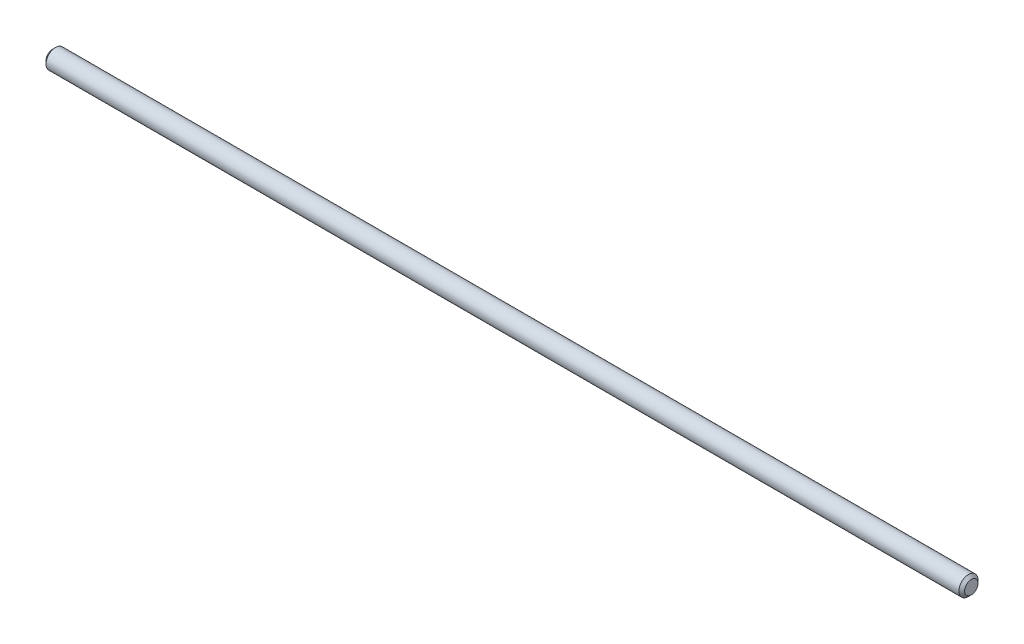
ISO-10303-21;
HEADER;
FILE_DESCRIPTION(('STEP AP214'),'2;1');
FILE_NAME('part.step','',(''),(''),'','','');
FILE_SCHEMA(('AUTOMOTIVE_DESIGN { 1 0 10303 214 1 1 1 1 }'));
ENDSEC;
DATA;
#1=APPLICATION_CONTEXT('core data for automotive mechanical design processes');
#2=APPLICATION_PROTOCOL_DEFINITION('international standard','automotive_design',2000,#1);
#3=PRODUCT_CONTEXT('',#1,'mechanical');
#4=PRODUCT('Part','Part','',(#3));
#5=PRODUCT_RELATED_PRODUCT_CATEGORY('part','',(#4));
#6=PRODUCT_DEFINITION_FORMATION('','',#4);
#7=PRODUCT_DEFINITION_CONTEXT('part definition',#1,'design');
#8=PRODUCT_DEFINITION('design','',#6,#7);
#9=PRODUCT_DEFINITION_SHAPE('','',#8);
#10=(LENGTH_UNIT() NAMED_UNIT(*) SI_UNIT(.MILLI.,.METRE.));
#11=(NAMED_UNIT(*) PLANE_ANGLE_UNIT() SI_UNIT($,.RADIAN.));
#12=(NAMED_UNIT(*) SI_UNIT($,.STERADIAN.) SOLID_ANGLE_UNIT());
#13=UNCERTAINTY_MEASURE_WITH_UNIT(LENGTH_MEASURE(1.E-05),#10,'distance_accuracy_value','');
#14=(GEOMETRIC_REPRESENTATION_CONTEXT(3) GLOBAL_UNCERTAINTY_ASSIGNED_CONTEXT((#13)) GLOBAL_UNIT_ASSIGNED_CONTEXT((#10,
#11,#12)) REPRESENTATION_CONTEXT('',''));
#15=CARTESIAN_POINT('',(0.,0.,0.));
#16=DIRECTION('',(0.,0.,1.));
#17=DIRECTION('',(1.,0.,0.));
#18=AXIS2_PLACEMENT_3D('',#15,#16,#17);
#19=CARTESIAN_POINT('',(-152.4,0.,0.));
#20=DIRECTION('',(1.,0.,0.));
#21=DIRECTION('',(0.,0.,-1.));
#22=AXIS2_PLACEMENT_3D('',#19,#20,#21);
#23=CYLINDRICAL_SURFACE('',#22,3.17499999999998);
#24=CARTESIAN_POINT('',(-151.4475,0.,0.));
#25=DIRECTION('',(1.,0.,0.));
#26=DIRECTION('',(0.,0.,-1.));
#27=AXIS2_PLACEMENT_3D('',#24,#25,#26);
#28=CIRCLE('',#27,3.17499999999998);
#29=CARTESIAN_POINT('',(-151.4475,0.,-3.17499999999998));
#30=VERTEX_POINT('',#29);
#31=EDGE_CURVE('E47',#30,#30,#28,.T.);
#32=ORIENTED_EDGE('',*,*,#31,.T.);
#33=EDGE_LOOP('',(#32));
#34=FACE_BOUND('',#33,.T.);
#35=CARTESIAN_POINT('',(151.4475,0.,0.));
#36=DIRECTION('',(1.,0.,0.));
#37=DIRECTION('',(0.,0.,-1.));
#38=AXIS2_PLACEMENT_3D('',#35,#36,#37);
#39=CIRCLE('',#38,3.17499999999998);
#40=CARTESIAN_POINT('',(151.4475,0.,-3.17499999999998));
#41=VERTEX_POINT('',#40);
#42=EDGE_CURVE('E51',#41,#41,#39,.F.);
#43=ORIENTED_EDGE('',*,*,#42,.T.);
#44=EDGE_LOOP('',(#43));
#45=FACE_BOUND('',#44,.T.);
#46=ADVANCED_FACE('F36',(#34,#45),#23,.T.);
#47=CARTESIAN_POINT('',(-152.4,0.,0.));
#48=DIRECTION('',(1.,0.,0.));
#49=DIRECTION('',(0.,0.,-1.));
#50=AXIS2_PLACEMENT_3D('',#47,#48,#49);
#51=PLANE('',#50);
#52=CARTESIAN_POINT('',(-152.4,0.,0.));
#53=DIRECTION('',(1.,0.,0.));
#54=DIRECTION('',(0.,0.,-1.));
#55=AXIS2_PLACEMENT_3D('',#52,#53,#54);
#56=CIRCLE('',#55,2.22249999999974);
#57=CARTESIAN_POINT('',(-152.4,0.,-2.22249999999974));
#58=VERTEX_POINT('',#57);
#59=EDGE_CURVE('E43',#58,#58,#56,.F.);
#60=ORIENTED_EDGE('',*,*,#59,.T.);
#61=EDGE_LOOP('',(#60));
#62=FACE_BOUND('',#61,.T.);
#63=ADVANCED_FACE('F67',(#62),#51,.F.);
#64=CARTESIAN_POINT('',(152.4,0.,0.));
#65=DIRECTION('',(1.,0.,0.));
#66=DIRECTION('',(0.,0.,-1.));
#67=AXIS2_PLACEMENT_3D('',#64,#65,#66);
#68=PLANE('',#67);
#69=CARTESIAN_POINT('',(152.4,0.,0.));
#70=DIRECTION('',(1.,0.,0.));
#71=DIRECTION('',(0.,0.,-1.));
#72=AXIS2_PLACEMENT_3D('',#69,#70,#71);
#73=CIRCLE('',#72,2.22249999999996);
#74=CARTESIAN_POINT('',(152.4,0.,-2.22249999999996));
#75=VERTEX_POINT('',#74);
#76=EDGE_CURVE('E10',#75,#75,#73,.T.);
#77=ORIENTED_EDGE('',*,*,#76,.T.);
#78=EDGE_LOOP('',(#77));
#79=FACE_BOUND('',#78,.T.);
#80=ADVANCED_FACE('F64',(#79),#68,.T.);
#81=CARTESIAN_POINT('',(-151.4475,0.,0.));
#82=DIRECTION('',(1.,0.,0.));
#83=DIRECTION('',(0.,0.,-1.));
#84=AXIS2_PLACEMENT_3D('',#81,#82,#83);
#85=CONICAL_SURFACE('',#84,3.17499999999998,0.785398163397462);
#86=ORIENTED_EDGE('',*,*,#59,.F.);
#87=EDGE_LOOP('',(#86));
#88=FACE_BOUND('',#87,.T.);
#89=ORIENTED_EDGE('',*,*,#31,.F.);
#90=EDGE_LOOP('',(#89));
#91=FACE_BOUND('',#90,.T.);
#92=ADVANCED_FACE('F60',(#88,#91),#85,.T.);
#93=CARTESIAN_POINT('',(152.4,0.,0.));
#94=DIRECTION('',(-1.,0.,0.));
#95=DIRECTION('',(0.,0.,1.));
#96=AXIS2_PLACEMENT_3D('',#93,#94,#95);
#97=CONICAL_SURFACE('',#96,2.22249999999996,0.785398163397477);
#98=ORIENTED_EDGE('',*,*,#42,.F.);
#99=EDGE_LOOP('',(#98));
#100=FACE_BOUND('',#99,.T.);
#101=ORIENTED_EDGE('',*,*,#76,.F.);
#102=EDGE_LOOP('',(#101));
#103=FACE_BOUND('',#102,.T.);
#104=ADVANCED_FACE('F38',(#100,#103),#97,.T.);
#105=CLOSED_SHELL('',(#46,#63,#80,#92,#104));
#106=MANIFOLD_SOLID_BREP('B2',#105);
#107=ADVANCED_BREP_SHAPE_REPRESENTATION('',(#18,#106),#14);
#108=SHAPE_DEFINITION_REPRESENTATION(#9,#107);
ENDSEC;
END-ISO-10303-21;
